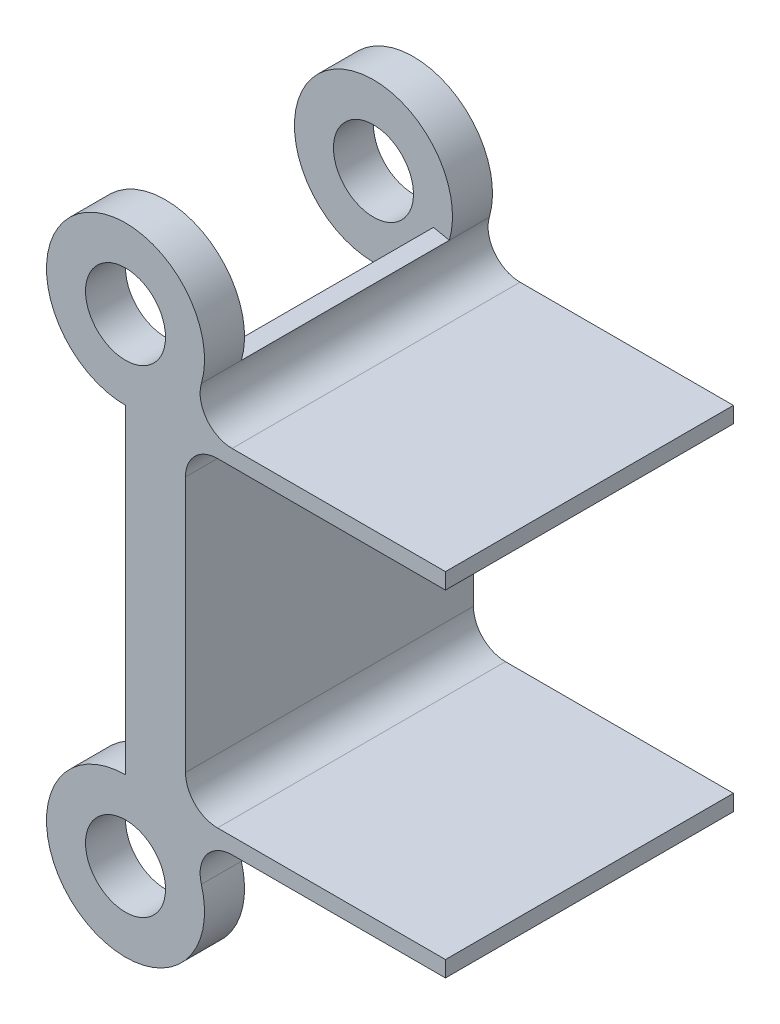
ISO-10303-21;
HEADER;
FILE_DESCRIPTION(('STEP AP214'),'2;1');
FILE_NAME('part.step','',(''),(''),'','','');
FILE_SCHEMA(('AUTOMOTIVE_DESIGN { 1 0 10303 214 1 1 1 1 }'));
ENDSEC;
DATA;
#1=APPLICATION_CONTEXT('core data for automotive mechanical design processes');
#2=APPLICATION_PROTOCOL_DEFINITION('international standard','automotive_design',2000,#1);
#3=PRODUCT_CONTEXT('',#1,'mechanical');
#4=PRODUCT('Part','Part','',(#3));
#5=PRODUCT_RELATED_PRODUCT_CATEGORY('part','',(#4));
#6=PRODUCT_DEFINITION_FORMATION('','',#4);
#7=PRODUCT_DEFINITION_CONTEXT('part definition',#1,'design');
#8=PRODUCT_DEFINITION('design','',#6,#7);
#9=PRODUCT_DEFINITION_SHAPE('','',#8);
#10=(LENGTH_UNIT() NAMED_UNIT(*) SI_UNIT(.MILLI.,.METRE.));
#11=(NAMED_UNIT(*) PLANE_ANGLE_UNIT() SI_UNIT($,.RADIAN.));
#12=(NAMED_UNIT(*) SI_UNIT($,.STERADIAN.) SOLID_ANGLE_UNIT());
#13=UNCERTAINTY_MEASURE_WITH_UNIT(LENGTH_MEASURE(1.E-05),#10,'distance_accuracy_value','');
#14=(GEOMETRIC_REPRESENTATION_CONTEXT(3) GLOBAL_UNCERTAINTY_ASSIGNED_CONTEXT((#13)) GLOBAL_UNIT_ASSIGNED_CONTEXT((#10,
#11,#12)) REPRESENTATION_CONTEXT('',''));
#15=CARTESIAN_POINT('',(0.,0.,0.));
#16=DIRECTION('',(0.,0.,1.));
#17=DIRECTION('',(1.,0.,0.));
#18=AXIS2_PLACEMENT_3D('',#15,#16,#17);
#19=CARTESIAN_POINT('',(0.,37.9476,22.86));
#20=DIRECTION('',(0.,0.,-1.));
#21=DIRECTION('',(-1.,0.,0.));
#22=AXIS2_PLACEMENT_3D('',#19,#20,#21);
#23=CYLINDRICAL_SURFACE('',#22,6.2738);
#24=DIRECTION('',(0.,0.,1.));
#25=VECTOR('',#24,1.);
#26=CARTESIAN_POINT('',(6.02369098499773,36.1938288184438,-5.09860980141071));
#27=LINE('',#26,#25);
#28=CARTESIAN_POINT('',(6.02369098499773,36.1938288184438,19.685));
#29=VERTEX_POINT('',#28);
#30=CARTESIAN_POINT('',(6.02369098499773,36.1938288184438,22.86));
#31=VERTEX_POINT('',#30);
#32=EDGE_CURVE('E206',#29,#31,#27,.T.);
#33=ORIENTED_EDGE('',*,*,#32,.F.);
#34=CARTESIAN_POINT('',(0.,37.9476,19.685));
#35=DIRECTION('',(0.,0.,1.));
#36=DIRECTION('',(-1.,0.,0.));
#37=AXIS2_PLACEMENT_3D('',#34,#35,#36);
#38=CIRCLE('',#37,6.2738);
#39=CARTESIAN_POINT('',(0.,31.6738,19.685));
#40=VERTEX_POINT('',#39);
#41=EDGE_CURVE('E669',#29,#40,#38,.T.);
#42=ORIENTED_EDGE('',*,*,#41,.T.);
#43=DIRECTION('',(0.,0.,-1.));
#44=VECTOR('',#43,1.);
#45=CARTESIAN_POINT('',(0.,31.6738,22.86));
#46=LINE('',#45,#44);
#47=CARTESIAN_POINT('',(0.,31.6738,22.86));
#48=VERTEX_POINT('',#47);
#49=EDGE_CURVE('E364',#48,#40,#46,.T.);
#50=ORIENTED_EDGE('',*,*,#49,.F.);
#51=CARTESIAN_POINT('',(0.,37.9476,22.86));
#52=DIRECTION('',(0.,0.,-1.));
#53=DIRECTION('',(1.,0.,0.));
#54=AXIS2_PLACEMENT_3D('',#51,#52,#53);
#55=CIRCLE('',#54,6.2738);
#56=EDGE_CURVE('E247',#48,#31,#55,.T.);
#57=ORIENTED_EDGE('',*,*,#56,.T.);
#58=EDGE_LOOP('',(#33,#42,#50,#57));
#59=FACE_BOUND('',#58,.T.);
#60=ADVANCED_FACE('F37',(#59),#23,.T.);
#61=CARTESIAN_POINT('',(0.,37.9476,22.86));
#62=DIRECTION('',(0.,0.,-1.));
#63=DIRECTION('',(-1.,0.,0.));
#64=AXIS2_PLACEMENT_3D('',#61,#62,#63);
#65=CYLINDRICAL_SURFACE('',#64,3.175);
#66=CARTESIAN_POINT('',(0.,37.9476,22.86));
#67=DIRECTION('',(0.,0.,-1.));
#68=DIRECTION('',(1.,0.,0.));
#69=AXIS2_PLACEMENT_3D('',#66,#67,#68);
#70=CIRCLE('',#69,3.175);
#71=CARTESIAN_POINT('',(3.175,37.9476,22.86));
#72=VERTEX_POINT('',#71);
#73=EDGE_CURVE('E241',#72,#72,#70,.T.);
#74=ORIENTED_EDGE('',*,*,#73,.F.);
#75=EDGE_LOOP('',(#74));
#76=FACE_BOUND('',#75,.T.);
#77=CARTESIAN_POINT('',(0.,37.9476,19.685));
#78=DIRECTION('',(0.,0.,-1.));
#79=DIRECTION('',(-1.,0.,0.));
#80=AXIS2_PLACEMENT_3D('',#77,#78,#79);
#81=CIRCLE('',#80,3.175);
#82=CARTESIAN_POINT('',(-3.175,37.9476,19.685));
#83=VERTEX_POINT('',#82);
#84=EDGE_CURVE('E235',#83,#83,#81,.F.);
#85=ORIENTED_EDGE('',*,*,#84,.F.);
#86=EDGE_LOOP('',(#85));
#87=FACE_BOUND('',#86,.T.);
#88=ADVANCED_FACE('F403',(#76,#87),#65,.F.);
#89=CARTESIAN_POINT('',(4.7625,4.08401275585667,-15.7054824963088));
#90=DIRECTION('',(1.,0.,0.));
#91=DIRECTION('',(0.,1.,0.));
#92=AXIS2_PLACEMENT_3D('',#89,#90,#91);
#93=PLANE('',#92);
#94=DIRECTION('',(0.,-1.,0.));
#95=VECTOR('',#94,1.);
#96=CARTESIAN_POINT('',(4.7625,4.08401275585667,0.));
#97=LINE('',#96,#95);
#98=CARTESIAN_POINT('',(4.7625,29.1338,0.));
#99=VERTEX_POINT('',#98);
#100=CARTESIAN_POINT('',(4.7625,8.8138,0.));
#101=VERTEX_POINT('',#100);
#102=EDGE_CURVE('E257',#99,#101,#97,.T.);
#103=ORIENTED_EDGE('',*,*,#102,.F.);
#104=DIRECTION('',(0.,0.,1.));
#105=VECTOR('',#104,1.);
#106=CARTESIAN_POINT('',(4.7625,29.1338,-15.7054824963088));
#107=LINE('',#106,#105);
#108=CARTESIAN_POINT('',(4.7625,29.1338,22.86));
#109=VERTEX_POINT('',#108);
#110=EDGE_CURVE('E367',#99,#109,#107,.T.);
#111=ORIENTED_EDGE('',*,*,#110,.T.);
#112=DIRECTION('',(0.,1.,0.));
#113=VECTOR('',#112,1.);
#114=CARTESIAN_POINT('',(4.7625,4.08401275585667,22.86));
#115=LINE('',#114,#113);
#116=CARTESIAN_POINT('',(4.7625,8.8138,22.86));
#117=VERTEX_POINT('',#116);
#118=EDGE_CURVE('E261',#117,#109,#115,.T.);
#119=ORIENTED_EDGE('',*,*,#118,.F.);
#120=DIRECTION('',(0.,0.,1.));
#121=VECTOR('',#120,1.);
#122=CARTESIAN_POINT('',(4.7625,8.8138,-15.7054824963088));
#123=LINE('',#122,#121);
#124=EDGE_CURVE('E356',#117,#101,#123,.F.);
#125=ORIENTED_EDGE('',*,*,#124,.T.);
#126=EDGE_LOOP('',(#103,#111,#119,#125));
#127=FACE_BOUND('',#126,.T.);
#128=ADVANCED_FACE('F386',(#127),#93,.T.);
#129=CARTESIAN_POINT('',(8.4624322744705,2.4638,22.86));
#130=DIRECTION('',(0.,0.,-1.));
#131=DIRECTION('',(-1.,0.,0.));
#132=AXIS2_PLACEMENT_3D('',#129,#130,#131);
#133=CYLINDRICAL_SURFACE('',#132,2.54);
#134=CARTESIAN_POINT('',(8.4624322744705,2.4638,16.51));
#135=DIRECTION('',(0.,0.,-1.));
#136=DIRECTION('',(-1.,0.,0.));
#137=AXIS2_PLACEMENT_3D('',#134,#135,#136);
#138=CIRCLE('',#137,2.54);
#139=CARTESIAN_POINT('',(8.46243227447051,5.0038,16.51));
#140=VERTEX_POINT('',#139);
#141=CARTESIAN_POINT('',(6.02369098499774,1.7537711815562,16.51));
#142=VERTEX_POINT('',#141);
#143=EDGE_CURVE('E274',#140,#142,#138,.F.);
#144=ORIENTED_EDGE('',*,*,#143,.F.);
#145=DIRECTION('',(0.,0.,-1.));
#146=VECTOR('',#145,1.);
#147=CARTESIAN_POINT('',(8.4624322744705,5.0038,0.));
#148=LINE('',#147,#146);
#149=CARTESIAN_POINT('',(8.4624322744705,5.0038,22.86));
#150=VERTEX_POINT('',#149);
#151=EDGE_CURVE('E338',#150,#140,#148,.T.);
#152=ORIENTED_EDGE('',*,*,#151,.F.);
#153=CARTESIAN_POINT('',(8.4624322744705,2.4638,22.86));
#154=DIRECTION('',(0.,0.,1.));
#155=DIRECTION('',(1.,0.,0.));
#156=AXIS2_PLACEMENT_3D('',#153,#154,#155);
#157=CIRCLE('',#156,2.54);
#158=CARTESIAN_POINT('',(6.02369098499774,1.7537711815562,22.86));
#159=VERTEX_POINT('',#158);
#160=EDGE_CURVE('E341',#159,#150,#157,.F.);
#161=ORIENTED_EDGE('',*,*,#160,.F.);
#162=DIRECTION('',(0.,0.,-1.));
#163=VECTOR('',#162,1.);
#164=CARTESIAN_POINT('',(6.02369098499774,1.7537711815562,22.86));
#165=LINE('',#164,#163);
#166=CARTESIAN_POINT('',(6.02369098499773,1.7537711815562,19.685));
#167=VERTEX_POINT('',#166);
#168=EDGE_CURVE('E329',#167,#159,#165,.F.);
#169=ORIENTED_EDGE('',*,*,#168,.F.);
#170=EDGE_CURVE('E337',#142,#167,#165,.F.);
#171=ORIENTED_EDGE('',*,*,#170,.F.);
#172=EDGE_LOOP('',(#144,#152,#161,#169,#171));
#173=FACE_BOUND('',#172,.T.);
#174=ADVANCED_FACE('F470',(#173),#133,.F.);
#175=CARTESIAN_POINT('',(0.,0.,22.86));
#176=DIRECTION('',(0.,0.,-1.));
#177=DIRECTION('',(-1.,0.,0.));
#178=AXIS2_PLACEMENT_3D('',#175,#176,#177);
#179=CYLINDRICAL_SURFACE('',#178,6.2738);
#180=CARTESIAN_POINT('',(0.,0.,19.685));
#181=DIRECTION('',(0.,0.,-1.));
#182=DIRECTION('',(-1.,0.,0.));
#183=AXIS2_PLACEMENT_3D('',#180,#181,#182);
#184=CIRCLE('',#183,6.2738);
#185=CARTESIAN_POINT('',(0.,6.2738,19.685));
#186=VERTEX_POINT('',#185);
#187=EDGE_CURVE('E284',#167,#186,#184,.T.);
#188=ORIENTED_EDGE('',*,*,#187,.F.);
#189=ORIENTED_EDGE('',*,*,#168,.T.);
#190=CARTESIAN_POINT('',(0.,0.,22.86));
#191=DIRECTION('',(0.,0.,1.));
#192=DIRECTION('',(1.,0.,0.));
#193=AXIS2_PLACEMENT_3D('',#190,#191,#192);
#194=CIRCLE('',#193,6.2738);
#195=CARTESIAN_POINT('',(0.,6.2738,22.86));
#196=VERTEX_POINT('',#195);
#197=EDGE_CURVE('E326',#196,#159,#194,.T.);
#198=ORIENTED_EDGE('',*,*,#197,.F.);
#199=DIRECTION('',(0.,0.,1.));
#200=VECTOR('',#199,1.);
#201=CARTESIAN_POINT('',(0.,6.2738,22.86));
#202=LINE('',#201,#200);
#203=EDGE_CURVE('E295',#186,#196,#202,.T.);
#204=ORIENTED_EDGE('',*,*,#203,.F.);
#205=EDGE_LOOP('',(#188,#189,#198,#204));
#206=FACE_BOUND('',#205,.T.);
#207=ADVANCED_FACE('F463',(#206),#179,.T.);
#208=CARTESIAN_POINT('',(0.,0.,22.86));
#209=DIRECTION('',(0.,0.,-1.));
#210=DIRECTION('',(-1.,0.,0.));
#211=AXIS2_PLACEMENT_3D('',#208,#209,#210);
#212=CYLINDRICAL_SURFACE('',#211,3.175);
#213=CARTESIAN_POINT('',(0.,0.,22.86));
#214=DIRECTION('',(0.,0.,1.));
#215=DIRECTION('',(1.,0.,0.));
#216=AXIS2_PLACEMENT_3D('',#213,#214,#215);
#217=CIRCLE('',#216,3.175);
#218=CARTESIAN_POINT('',(3.175,0.,22.86));
#219=VERTEX_POINT('',#218);
#220=EDGE_CURVE('E320',#219,#219,#217,.T.);
#221=ORIENTED_EDGE('',*,*,#220,.T.);
#222=EDGE_LOOP('',(#221));
#223=FACE_BOUND('',#222,.T.);
#224=CARTESIAN_POINT('',(0.,0.,19.685));
#225=DIRECTION('',(0.,0.,-1.));
#226=DIRECTION('',(-1.,0.,0.));
#227=AXIS2_PLACEMENT_3D('',#224,#225,#226);
#228=CIRCLE('',#227,3.175);
#229=CARTESIAN_POINT('',(-3.175,0.,19.685));
#230=VERTEX_POINT('',#229);
#231=EDGE_CURVE('E289',#230,#230,#228,.T.);
#232=ORIENTED_EDGE('',*,*,#231,.T.);
#233=EDGE_LOOP('',(#232));
#234=FACE_BOUND('',#233,.T.);
#235=ADVANCED_FACE('F528',(#223,#234),#212,.F.);
#236=CARTESIAN_POINT('',(0.,0.,22.86));
#237=DIRECTION('',(0.,0.,1.));
#238=DIRECTION('',(1.,0.,0.));
#239=AXIS2_PLACEMENT_3D('',#236,#237,#238);
#240=PLANE('',#239);
#241=CARTESIAN_POINT('',(8.4624322744705,35.4838,22.86));
#242=DIRECTION('',(0.,0.,-1.));
#243=DIRECTION('',(1.,0.,0.));
#244=AXIS2_PLACEMENT_3D('',#241,#242,#243);
#245=CIRCLE('',#244,2.54);
#246=CARTESIAN_POINT('',(8.4624322744705,32.9438,22.86));
#247=VERTEX_POINT('',#246);
#248=EDGE_CURVE('E199',#247,#31,#245,.T.);
#249=ORIENTED_EDGE('',*,*,#248,.T.);
#250=ORIENTED_EDGE('',*,*,#56,.F.);
#251=DIRECTION('',(0.,1.,0.));
#252=VECTOR('',#251,1.);
#253=CARTESIAN_POINT('',(0.,6.2738,22.86));
#254=LINE('',#253,#252);
#255=EDGE_CURVE('E254',#196,#48,#254,.T.);
#256=ORIENTED_EDGE('',*,*,#255,.F.);
#257=ORIENTED_EDGE('',*,*,#197,.T.);
#258=ORIENTED_EDGE('',*,*,#160,.T.);
#259=DIRECTION('',(1.,0.,0.));
#260=VECTOR('',#259,1.);
#261=CARTESIAN_POINT('',(0.,5.0038,22.86));
#262=LINE('',#261,#260);
#263=CARTESIAN_POINT('',(25.4,5.0038,22.86));
#264=VERTEX_POINT('',#263);
#265=EDGE_CURVE('E296',#150,#264,#262,.T.);
#266=ORIENTED_EDGE('',*,*,#265,.T.);
#267=DIRECTION('',(0.,1.,0.));
#268=VECTOR('',#267,1.);
#269=CARTESIAN_POINT('',(25.4,5.0038,22.86));
#270=LINE('',#269,#268);
#271=CARTESIAN_POINT('',(25.4,6.2738,22.86));
#272=VERTEX_POINT('',#271);
#273=EDGE_CURVE('E305',#264,#272,#270,.T.);
#274=ORIENTED_EDGE('',*,*,#273,.T.);
#275=DIRECTION('',(1.,0.,0.));
#276=VECTOR('',#275,1.);
#277=CARTESIAN_POINT('',(0.,6.2738,22.86));
#278=LINE('',#277,#276);
#279=CARTESIAN_POINT('',(7.3025,6.2738,22.86));
#280=VERTEX_POINT('',#279);
#281=EDGE_CURVE('E308',#280,#272,#278,.T.);
#282=ORIENTED_EDGE('',*,*,#281,.F.);
#283=CARTESIAN_POINT('',(7.3025,8.8138,22.86));
#284=DIRECTION('',(0.,0.,1.));
#285=DIRECTION('',(1.,0.,0.));
#286=AXIS2_PLACEMENT_3D('',#283,#284,#285);
#287=CIRCLE('',#286,2.54);
#288=EDGE_CURVE('E359',#280,#117,#287,.F.);
#289=ORIENTED_EDGE('',*,*,#288,.T.);
#290=ORIENTED_EDGE('',*,*,#118,.T.);
#291=CARTESIAN_POINT('',(7.3025,29.1338,22.86));
#292=DIRECTION('',(0.,0.,1.));
#293=DIRECTION('',(1.,0.,0.));
#294=AXIS2_PLACEMENT_3D('',#291,#292,#293);
#295=CIRCLE('',#294,2.54);
#296=CARTESIAN_POINT('',(7.3025,31.6738,22.86));
#297=VERTEX_POINT('',#296);
#298=EDGE_CURVE('E52',#109,#297,#295,.F.);
#299=ORIENTED_EDGE('',*,*,#298,.T.);
#300=DIRECTION('',(1.,0.,0.));
#301=VECTOR('',#300,1.);
#302=CARTESIAN_POINT('',(0.,31.6738,22.86));
#303=LINE('',#302,#301);
#304=CARTESIAN_POINT('',(25.4,31.6738,22.86));
#305=VERTEX_POINT('',#304);
#306=EDGE_CURVE('E237',#297,#305,#303,.T.);
#307=ORIENTED_EDGE('',*,*,#306,.T.);
#308=DIRECTION('',(0.,-1.,0.));
#309=VECTOR('',#308,1.);
#310=CARTESIAN_POINT('',(25.4,32.9438,22.86));
#311=LINE('',#310,#309);
#312=CARTESIAN_POINT('',(25.4,32.9438,22.86));
#313=VERTEX_POINT('',#312);
#314=EDGE_CURVE('E222',#313,#305,#311,.T.);
#315=ORIENTED_EDGE('',*,*,#314,.F.);
#316=DIRECTION('',(1.,0.,0.));
#317=VECTOR('',#316,1.);
#318=CARTESIAN_POINT('',(0.,32.9438,22.86));
#319=LINE('',#318,#317);
#320=EDGE_CURVE('E214',#247,#313,#319,.T.);
#321=ORIENTED_EDGE('',*,*,#320,.F.);
#322=EDGE_LOOP('',(#249,#250,#256,#257,#258,#266,#274,#282,#289,#290,#299,#307,#315,#321));
#323=FACE_BOUND('',#322,.T.);
#324=ORIENTED_EDGE('',*,*,#73,.T.);
#325=EDGE_LOOP('',(#324));
#326=FACE_BOUND('',#325,.T.);
#327=ORIENTED_EDGE('',*,*,#220,.F.);
#328=EDGE_LOOP('',(#327));
#329=FACE_BOUND('',#328,.T.);
#330=ADVANCED_FACE('F219',(#323,#326,#329),#240,.T.);
#331=CARTESIAN_POINT('',(0.,0.,0.));
#332=DIRECTION('',(0.,0.,1.));
#333=DIRECTION('',(1.,0.,0.));
#334=AXIS2_PLACEMENT_3D('',#331,#332,#333);
#335=PLANE('',#334);
#336=CARTESIAN_POINT('',(0.,37.9476,0.));
#337=DIRECTION('',(0.,0.,-1.));
#338=DIRECTION('',(1.,0.,0.));
#339=AXIS2_PLACEMENT_3D('',#336,#337,#338);
#340=CIRCLE('',#339,6.2738);
#341=CARTESIAN_POINT('',(0.,31.6738,0.));
#342=VERTEX_POINT('',#341);
#343=CARTESIAN_POINT('',(6.02369098499773,36.1938288184438,0.));
#344=VERTEX_POINT('',#343);
#345=EDGE_CURVE('E244',#342,#344,#340,.T.);
#346=ORIENTED_EDGE('',*,*,#345,.T.);
#347=CARTESIAN_POINT('',(8.4624322744705,35.4838,0.));
#348=DIRECTION('',(0.,0.,1.));
#349=DIRECTION('',(1.,0.,0.));
#350=AXIS2_PLACEMENT_3D('',#347,#348,#349);
#351=CIRCLE('',#350,2.54);
#352=CARTESIAN_POINT('',(8.4624322744705,32.9438,0.));
#353=VERTEX_POINT('',#352);
#354=EDGE_CURVE('E434',#344,#353,#351,.T.);
#355=ORIENTED_EDGE('',*,*,#354,.T.);
#356=DIRECTION('',(-1.,0.,0.));
#357=VECTOR('',#356,1.);
#358=CARTESIAN_POINT('',(0.,32.9438,0.));
#359=LINE('',#358,#357);
#360=CARTESIAN_POINT('',(25.4,32.9438,0.));
#361=VERTEX_POINT('',#360);
#362=EDGE_CURVE('E217',#361,#353,#359,.T.);
#363=ORIENTED_EDGE('',*,*,#362,.F.);
#364=DIRECTION('',(0.,-1.,0.));
#365=VECTOR('',#364,1.);
#366=CARTESIAN_POINT('',(25.4,32.9438,0.));
#367=LINE('',#366,#365);
#368=CARTESIAN_POINT('',(25.4,31.6738,0.));
#369=VERTEX_POINT('',#368);
#370=EDGE_CURVE('E224',#361,#369,#367,.T.);
#371=ORIENTED_EDGE('',*,*,#370,.T.);
#372=DIRECTION('',(-1.,0.,0.));
#373=VECTOR('',#372,1.);
#374=CARTESIAN_POINT('',(0.,31.6738,0.));
#375=LINE('',#374,#373);
#376=CARTESIAN_POINT('',(7.3025,31.6738,0.));
#377=VERTEX_POINT('',#376);
#378=EDGE_CURVE('E232',#369,#377,#375,.T.);
#379=ORIENTED_EDGE('',*,*,#378,.T.);
#380=CARTESIAN_POINT('',(7.3025,29.1338,0.));
#381=DIRECTION('',(0.,0.,1.));
#382=DIRECTION('',(1.,0.,0.));
#383=AXIS2_PLACEMENT_3D('',#380,#381,#382);
#384=CIRCLE('',#383,2.54);
#385=EDGE_CURVE('E45',#377,#99,#384,.T.);
#386=ORIENTED_EDGE('',*,*,#385,.T.);
#387=ORIENTED_EDGE('',*,*,#102,.T.);
#388=CARTESIAN_POINT('',(7.3025,8.8138,0.));
#389=DIRECTION('',(0.,0.,1.));
#390=DIRECTION('',(1.,0.,0.));
#391=AXIS2_PLACEMENT_3D('',#388,#389,#390);
#392=CIRCLE('',#391,2.54);
#393=CARTESIAN_POINT('',(7.3025,6.2738,0.));
#394=VERTEX_POINT('',#393);
#395=EDGE_CURVE('E361',#101,#394,#392,.T.);
#396=ORIENTED_EDGE('',*,*,#395,.T.);
#397=DIRECTION('',(-1.,0.,0.));
#398=VECTOR('',#397,1.);
#399=CARTESIAN_POINT('',(0.,6.2738,0.));
#400=LINE('',#399,#398);
#401=CARTESIAN_POINT('',(25.4,6.2738,0.));
#402=VERTEX_POINT('',#401);
#403=EDGE_CURVE('E299',#402,#394,#400,.T.);
#404=ORIENTED_EDGE('',*,*,#403,.F.);
#405=DIRECTION('',(0.,1.,0.));
#406=VECTOR('',#405,1.);
#407=CARTESIAN_POINT('',(25.4,5.0038,0.));
#408=LINE('',#407,#406);
#409=CARTESIAN_POINT('',(25.4,5.0038,0.));
#410=VERTEX_POINT('',#409);
#411=EDGE_CURVE('E315',#410,#402,#408,.T.);
#412=ORIENTED_EDGE('',*,*,#411,.F.);
#413=DIRECTION('',(-1.,0.,0.));
#414=VECTOR('',#413,1.);
#415=CARTESIAN_POINT('',(0.,5.0038,0.));
#416=LINE('',#415,#414);
#417=CARTESIAN_POINT('',(8.4624322744705,5.0038,0.));
#418=VERTEX_POINT('',#417);
#419=EDGE_CURVE('E302',#410,#418,#416,.T.);
#420=ORIENTED_EDGE('',*,*,#419,.T.);
#421=CARTESIAN_POINT('',(8.4624322744705,2.4638,0.));
#422=DIRECTION('',(0.,0.,1.));
#423=DIRECTION('',(1.,0.,0.));
#424=AXIS2_PLACEMENT_3D('',#421,#422,#423);
#425=CIRCLE('',#424,2.54);
#426=CARTESIAN_POINT('',(6.02369098499774,1.7537711815562,0.));
#427=VERTEX_POINT('',#426);
#428=EDGE_CURVE('E343',#418,#427,#425,.T.);
#429=ORIENTED_EDGE('',*,*,#428,.T.);
#430=CARTESIAN_POINT('',(0.,0.,0.));
#431=DIRECTION('',(0.,0.,1.));
#432=DIRECTION('',(1.,0.,0.));
#433=AXIS2_PLACEMENT_3D('',#430,#431,#432);
#434=CIRCLE('',#433,6.2738);
#435=CARTESIAN_POINT('',(0.,6.2738,0.));
#436=VERTEX_POINT('',#435);
#437=EDGE_CURVE('E323',#436,#427,#434,.T.);
#438=ORIENTED_EDGE('',*,*,#437,.F.);
#439=DIRECTION('',(0.,-1.,0.));
#440=VECTOR('',#439,1.);
#441=CARTESIAN_POINT('',(0.,6.2738,0.));
#442=LINE('',#441,#440);
#443=EDGE_CURVE('E255',#342,#436,#442,.T.);
#444=ORIENTED_EDGE('',*,*,#443,.F.);
#445=EDGE_LOOP('',(#346,#355,#363,#371,#379,#386,#387,#396,#404,#412,#420,#429,#438,#444));
#446=FACE_BOUND('',#445,.T.);
#447=CARTESIAN_POINT('',(0.,37.9476,0.));
#448=DIRECTION('',(0.,0.,-1.));
#449=DIRECTION('',(1.,0.,0.));
#450=AXIS2_PLACEMENT_3D('',#447,#448,#449);
#451=CIRCLE('',#450,3.175);
#452=CARTESIAN_POINT('',(3.175,37.9476,0.));
#453=VERTEX_POINT('',#452);
#454=EDGE_CURVE('E239',#453,#453,#451,.T.);
#455=ORIENTED_EDGE('',*,*,#454,.F.);
#456=EDGE_LOOP('',(#455));
#457=FACE_BOUND('',#456,.T.);
#458=CARTESIAN_POINT('',(0.,0.,0.));
#459=DIRECTION('',(0.,0.,1.));
#460=DIRECTION('',(1.,0.,0.));
#461=AXIS2_PLACEMENT_3D('',#458,#459,#460);
#462=CIRCLE('',#461,3.175);
#463=CARTESIAN_POINT('',(3.175,0.,0.));
#464=VERTEX_POINT('',#463);
#465=EDGE_CURVE('E317',#464,#464,#462,.T.);
#466=ORIENTED_EDGE('',*,*,#465,.T.);
#467=EDGE_LOOP('',(#466));
#468=FACE_BOUND('',#467,.T.);
#469=ADVANCED_FACE('F381',(#446,#457,#468),#335,.F.);
#470=CARTESIAN_POINT('',(6.02369098499774,1.7537711815562,3.175));
#471=VERTEX_POINT('',#470);
#472=EDGE_CURVE('E332',#427,#471,#165,.F.);
#473=ORIENTED_EDGE('',*,*,#472,.T.);
#474=CARTESIAN_POINT('',(0.,0.,3.175));
#475=DIRECTION('',(0.,0.,-1.));
#476=DIRECTION('',(-1.,0.,0.));
#477=AXIS2_PLACEMENT_3D('',#474,#475,#476);
#478=CIRCLE('',#477,6.2738);
#479=CARTESIAN_POINT('',(0.,6.2738,3.175));
#480=VERTEX_POINT('',#479);
#481=EDGE_CURVE('E280',#471,#480,#478,.T.);
#482=ORIENTED_EDGE('',*,*,#481,.T.);
#483=EDGE_CURVE('E306',#436,#480,#202,.T.);
#484=ORIENTED_EDGE('',*,*,#483,.F.);
#485=ORIENTED_EDGE('',*,*,#437,.T.);
#486=EDGE_LOOP('',(#473,#482,#484,#485));
#487=FACE_BOUND('',#486,.T.);
#488=ADVANCED_FACE('F443',(#487),#179,.T.);
#489=CARTESIAN_POINT('',(0.,0.,3.175));
#490=DIRECTION('',(0.,0.,-1.));
#491=DIRECTION('',(-1.,0.,0.));
#492=AXIS2_PLACEMENT_3D('',#489,#490,#491);
#493=CIRCLE('',#492,3.175);
#494=CARTESIAN_POINT('',(-3.175,0.,3.175));
#495=VERTEX_POINT('',#494);
#496=EDGE_CURVE('E283',#495,#495,#493,.T.);
#497=ORIENTED_EDGE('',*,*,#496,.F.);
#498=EDGE_LOOP('',(#497));
#499=FACE_BOUND('',#498,.T.);
#500=ORIENTED_EDGE('',*,*,#465,.F.);
#501=EDGE_LOOP('',(#500));
#502=FACE_BOUND('',#501,.T.);
#503=ADVANCED_FACE('F520',(#499,#502),#212,.F.);
#504=CARTESIAN_POINT('',(0.,5.0038,0.));
#505=DIRECTION('',(0.,-1.,0.));
#506=DIRECTION('',(0.,0.,-1.));
#507=AXIS2_PLACEMENT_3D('',#504,#505,#506);
#508=PLANE('',#507);
#509=DIRECTION('',(0.,0.,1.));
#510=VECTOR('',#509,1.);
#511=CARTESIAN_POINT('',(4.7625,5.0038,0.));
#512=LINE('',#511,#510);
#513=CARTESIAN_POINT('',(4.7625,5.0038,6.35));
#514=VERTEX_POINT('',#513);
#515=CARTESIAN_POINT('',(4.7625,5.0038,16.51));
#516=VERTEX_POINT('',#515);
#517=EDGE_CURVE('E266',#514,#516,#512,.T.);
#518=ORIENTED_EDGE('',*,*,#517,.F.);
#519=DIRECTION('',(1.,0.,0.));
#520=VECTOR('',#519,1.);
#521=CARTESIAN_POINT('',(8.46243227447051,5.0038,6.35));
#522=LINE('',#521,#520);
#523=CARTESIAN_POINT('',(8.46243227447051,5.0038,6.35));
#524=VERTEX_POINT('',#523);
#525=EDGE_CURVE('E272',#514,#524,#522,.T.);
#526=ORIENTED_EDGE('',*,*,#525,.T.);
#527=EDGE_CURVE('E335',#524,#418,#148,.T.);
#528=ORIENTED_EDGE('',*,*,#527,.T.);
#529=ORIENTED_EDGE('',*,*,#419,.F.);
#530=DIRECTION('',(0.,0.,-1.));
#531=VECTOR('',#530,1.);
#532=CARTESIAN_POINT('',(25.4,5.0038,22.86));
#533=LINE('',#532,#531);
#534=EDGE_CURVE('E298',#264,#410,#533,.T.);
#535=ORIENTED_EDGE('',*,*,#534,.F.);
#536=ORIENTED_EDGE('',*,*,#265,.F.);
#537=ORIENTED_EDGE('',*,*,#151,.T.);
#538=DIRECTION('',(1.,0.,0.));
#539=VECTOR('',#538,1.);
#540=CARTESIAN_POINT('',(8.46243227447051,5.0038,16.51));
#541=LINE('',#540,#539);
#542=EDGE_CURVE('E271',#516,#140,#541,.T.);
#543=ORIENTED_EDGE('',*,*,#542,.F.);
#544=EDGE_LOOP('',(#518,#526,#528,#529,#535,#536,#537,#543));
#545=FACE_BOUND('',#544,.T.);
#546=ADVANCED_FACE('F481',(#545),#508,.T.);
#547=CARTESIAN_POINT('',(25.4,5.0038,22.86));
#548=DIRECTION('',(1.,0.,0.));
#549=DIRECTION('',(0.,0.,-1.));
#550=AXIS2_PLACEMENT_3D('',#547,#548,#549);
#551=PLANE('',#550);
#552=DIRECTION('',(0.,0.,-1.));
#553=VECTOR('',#552,1.);
#554=CARTESIAN_POINT('',(25.4,6.2738,22.86));
#555=LINE('',#554,#553);
#556=EDGE_CURVE('E310',#272,#402,#555,.T.);
#557=ORIENTED_EDGE('',*,*,#556,.F.);
#558=ORIENTED_EDGE('',*,*,#273,.F.);
#559=ORIENTED_EDGE('',*,*,#534,.T.);
#560=ORIENTED_EDGE('',*,*,#411,.T.);
#561=EDGE_LOOP('',(#557,#558,#559,#560));
#562=FACE_BOUND('',#561,.T.);
#563=ADVANCED_FACE('F488',(#562),#551,.T.);
#564=CARTESIAN_POINT('',(0.,6.2738,0.));
#565=DIRECTION('',(0.,-1.,0.));
#566=DIRECTION('',(0.,0.,-1.));
#567=AXIS2_PLACEMENT_3D('',#564,#565,#566);
#568=PLANE('',#567);
#569=ORIENTED_EDGE('',*,*,#403,.T.);
#570=DIRECTION('',(0.,0.,1.));
#571=VECTOR('',#570,1.);
#572=CARTESIAN_POINT('',(7.3025,6.2738,0.));
#573=LINE('',#572,#571);
#574=EDGE_CURVE('E353',#394,#280,#573,.T.);
#575=ORIENTED_EDGE('',*,*,#574,.T.);
#576=ORIENTED_EDGE('',*,*,#281,.T.);
#577=ORIENTED_EDGE('',*,*,#556,.T.);
#578=EDGE_LOOP('',(#569,#575,#576,#577));
#579=FACE_BOUND('',#578,.T.);
#580=ADVANCED_FACE('F491',(#579),#568,.F.);
#581=ORIENTED_EDGE('',*,*,#527,.F.);
#582=CARTESIAN_POINT('',(8.4624322744705,2.4638,6.35));
#583=DIRECTION('',(0.,0.,-1.));
#584=DIRECTION('',(-1.,0.,0.));
#585=AXIS2_PLACEMENT_3D('',#582,#583,#584);
#586=CIRCLE('',#585,2.54);
#587=CARTESIAN_POINT('',(6.02369098499773,1.7537711815562,6.35));
#588=VERTEX_POINT('',#587);
#589=EDGE_CURVE('E277',#524,#588,#586,.F.);
#590=ORIENTED_EDGE('',*,*,#589,.T.);
#591=EDGE_CURVE('E336',#471,#588,#165,.F.);
#592=ORIENTED_EDGE('',*,*,#591,.F.);
#593=ORIENTED_EDGE('',*,*,#472,.F.);
#594=ORIENTED_EDGE('',*,*,#428,.F.);
#595=EDGE_LOOP('',(#581,#590,#592,#593,#594));
#596=FACE_BOUND('',#595,.T.);
#597=ADVANCED_FACE('F453',(#596),#133,.F.);
#598=CARTESIAN_POINT('',(0.,0.,19.685));
#599=DIRECTION('',(0.,0.,-1.));
#600=DIRECTION('',(-1.,0.,0.));
#601=AXIS2_PLACEMENT_3D('',#598,#599,#600);
#602=CYLINDRICAL_SURFACE('',#601,6.2738);
#603=CARTESIAN_POINT('',(0.,0.,6.35));
#604=DIRECTION('',(0.,0.,-1.));
#605=DIRECTION('',(-1.,0.,0.));
#606=AXIS2_PLACEMENT_3D('',#603,#604,#605);
#607=CIRCLE('',#606,6.2738);
#608=CARTESIAN_POINT('',(4.7625,4.08401275585667,6.35));
#609=VERTEX_POINT('',#608);
#610=EDGE_CURVE('E347',#588,#609,#607,.F.);
#611=ORIENTED_EDGE('',*,*,#610,.T.);
#612=DIRECTION('',(0.,0.,1.));
#613=VECTOR('',#612,1.);
#614=CARTESIAN_POINT('',(4.7625,4.08401275585667,-15.7054824963088));
#615=LINE('',#614,#613);
#616=CARTESIAN_POINT('',(4.7625,4.08401275585667,16.51));
#617=VERTEX_POINT('',#616);
#618=EDGE_CURVE('E258',#609,#617,#615,.T.);
#619=ORIENTED_EDGE('',*,*,#618,.T.);
#620=CARTESIAN_POINT('',(0.,0.,16.51));
#621=DIRECTION('',(0.,0.,-1.));
#622=DIRECTION('',(-1.,0.,0.));
#623=AXIS2_PLACEMENT_3D('',#620,#621,#622);
#624=CIRCLE('',#623,6.2738);
#625=EDGE_CURVE('E345',#142,#617,#624,.F.);
#626=ORIENTED_EDGE('',*,*,#625,.F.);
#627=ORIENTED_EDGE('',*,*,#170,.T.);
#628=EDGE_CURVE('E281',#186,#167,#184,.T.);
#629=ORIENTED_EDGE('',*,*,#628,.F.);
#630=DIRECTION('',(0.,0.,-1.));
#631=VECTOR('',#630,1.);
#632=CARTESIAN_POINT('',(0.,6.2738,19.685));
#633=LINE('',#632,#631);
#634=EDGE_CURVE('E292',#186,#480,#633,.T.);
#635=ORIENTED_EDGE('',*,*,#634,.T.);
#636=EDGE_CURVE('E285',#480,#471,#478,.T.);
#637=ORIENTED_EDGE('',*,*,#636,.T.);
#638=ORIENTED_EDGE('',*,*,#591,.T.);
#639=EDGE_LOOP('',(#611,#619,#626,#627,#629,#635,#637,#638));
#640=FACE_BOUND('',#639,.T.);
#641=ADVANCED_FACE('F476',(#640),#602,.F.);
#642=CARTESIAN_POINT('',(0.,0.,19.685));
#643=DIRECTION('',(0.,0.,-1.));
#644=DIRECTION('',(-1.,0.,0.));
#645=AXIS2_PLACEMENT_3D('',#642,#643,#644);
#646=PLANE('',#645);
#647=ORIENTED_EDGE('',*,*,#231,.F.);
#648=EDGE_LOOP('',(#647));
#649=FACE_BOUND('',#648,.T.);
#650=ORIENTED_EDGE('',*,*,#628,.T.);
#651=ORIENTED_EDGE('',*,*,#187,.T.);
#652=EDGE_LOOP('',(#650,#651));
#653=FACE_BOUND('',#652,.T.);
#654=ADVANCED_FACE('F475',(#649,#653),#646,.T.);
#655=CARTESIAN_POINT('',(0.,0.,3.175));
#656=DIRECTION('',(0.,0.,-1.));
#657=DIRECTION('',(-1.,0.,0.));
#658=AXIS2_PLACEMENT_3D('',#655,#656,#657);
#659=PLANE('',#658);
#660=ORIENTED_EDGE('',*,*,#496,.T.);
#661=EDGE_LOOP('',(#660));
#662=FACE_BOUND('',#661,.T.);
#663=ORIENTED_EDGE('',*,*,#636,.F.);
#664=ORIENTED_EDGE('',*,*,#481,.F.);
#665=EDGE_LOOP('',(#663,#664));
#666=FACE_BOUND('',#665,.T.);
#667=ADVANCED_FACE('F449',(#662,#666),#659,.F.);
#668=CARTESIAN_POINT('',(0.,0.,6.35));
#669=DIRECTION('',(0.,0.,-1.));
#670=DIRECTION('',(-1.,0.,0.));
#671=AXIS2_PLACEMENT_3D('',#668,#669,#670);
#672=PLANE('',#671);
#673=ORIENTED_EDGE('',*,*,#525,.F.);
#674=DIRECTION('',(0.,-1.,0.));
#675=VECTOR('',#674,1.);
#676=CARTESIAN_POINT('',(4.7625,0.,6.35));
#677=LINE('',#676,#675);
#678=EDGE_CURVE('E269',#514,#609,#677,.T.);
#679=ORIENTED_EDGE('',*,*,#678,.T.);
#680=ORIENTED_EDGE('',*,*,#610,.F.);
#681=ORIENTED_EDGE('',*,*,#589,.F.);
#682=EDGE_LOOP('',(#673,#679,#680,#681));
#683=FACE_BOUND('',#682,.T.);
#684=ADVANCED_FACE('F496',(#683),#672,.F.);
#685=CARTESIAN_POINT('',(0.,0.,16.51));
#686=DIRECTION('',(0.,0.,-1.));
#687=DIRECTION('',(-1.,0.,0.));
#688=AXIS2_PLACEMENT_3D('',#685,#686,#687);
#689=PLANE('',#688);
#690=DIRECTION('',(0.,-1.,0.));
#691=VECTOR('',#690,1.);
#692=CARTESIAN_POINT('',(4.7625,0.,16.51));
#693=LINE('',#692,#691);
#694=EDGE_CURVE('E350',#516,#617,#693,.T.);
#695=ORIENTED_EDGE('',*,*,#694,.F.);
#696=ORIENTED_EDGE('',*,*,#542,.T.);
#697=ORIENTED_EDGE('',*,*,#143,.T.);
#698=ORIENTED_EDGE('',*,*,#625,.T.);
#699=EDGE_LOOP('',(#695,#696,#697,#698));
#700=FACE_BOUND('',#699,.T.);
#701=ADVANCED_FACE('F500',(#700),#689,.T.);
#702=ORIENTED_EDGE('',*,*,#678,.F.);
#703=ORIENTED_EDGE('',*,*,#517,.T.);
#704=ORIENTED_EDGE('',*,*,#694,.T.);
#705=ORIENTED_EDGE('',*,*,#618,.F.);
#706=EDGE_LOOP('',(#702,#703,#704,#705));
#707=FACE_BOUND('',#706,.T.);
#708=ADVANCED_FACE('F499',(#707),#93,.T.);
#709=CARTESIAN_POINT('',(0.,6.2738,-15.7054824963088));
#710=DIRECTION('',(1.,0.,0.));
#711=DIRECTION('',(0.,0.,-1.));
#712=AXIS2_PLACEMENT_3D('',#709,#710,#711);
#713=PLANE('',#712);
#714=ORIENTED_EDGE('',*,*,#255,.T.);
#715=ORIENTED_EDGE('',*,*,#49,.T.);
#716=CARTESIAN_POINT('',(0.,31.6738,3.175));
#717=VERTEX_POINT('',#716);
#718=EDGE_CURVE('E368',#40,#717,#46,.T.);
#719=ORIENTED_EDGE('',*,*,#718,.T.);
#720=EDGE_CURVE('E363',#717,#342,#46,.T.);
#721=ORIENTED_EDGE('',*,*,#720,.T.);
#722=ORIENTED_EDGE('',*,*,#443,.T.);
#723=ORIENTED_EDGE('',*,*,#483,.T.);
#724=ORIENTED_EDGE('',*,*,#634,.F.);
#725=ORIENTED_EDGE('',*,*,#203,.T.);
#726=EDGE_LOOP('',(#714,#715,#719,#721,#722,#723,#724,#725));
#727=FACE_BOUND('',#726,.T.);
#728=ADVANCED_FACE('F424',(#727),#713,.F.);
#729=CARTESIAN_POINT('',(7.3025,8.8138,0.));
#730=DIRECTION('',(0.,0.,1.));
#731=DIRECTION('',(1.,0.,0.));
#732=AXIS2_PLACEMENT_3D('',#729,#730,#731);
#733=CYLINDRICAL_SURFACE('',#732,2.54);
#734=ORIENTED_EDGE('',*,*,#395,.F.);
#735=ORIENTED_EDGE('',*,*,#124,.F.);
#736=ORIENTED_EDGE('',*,*,#288,.F.);
#737=ORIENTED_EDGE('',*,*,#574,.F.);
#738=EDGE_LOOP('',(#734,#735,#736,#737));
#739=FACE_BOUND('',#738,.T.);
#740=ADVANCED_FACE('F416',(#739),#733,.F.);
#741=CARTESIAN_POINT('',(6.02369098499773,36.1938288184438,3.175));
#742=VERTEX_POINT('',#741);
#743=EDGE_CURVE('E430',#344,#742,#27,.T.);
#744=ORIENTED_EDGE('',*,*,#743,.F.);
#745=ORIENTED_EDGE('',*,*,#345,.F.);
#746=ORIENTED_EDGE('',*,*,#720,.F.);
#747=CARTESIAN_POINT('',(0.,37.9476,3.175));
#748=DIRECTION('',(0.,0.,1.));
#749=DIRECTION('',(-1.,0.,0.));
#750=AXIS2_PLACEMENT_3D('',#747,#748,#749);
#751=CIRCLE('',#750,6.2738);
#752=EDGE_CURVE('E433',#742,#717,#751,.T.);
#753=ORIENTED_EDGE('',*,*,#752,.F.);
#754=EDGE_LOOP('',(#744,#745,#746,#753));
#755=FACE_BOUND('',#754,.T.);
#756=ADVANCED_FACE('F406',(#755),#23,.T.);
#757=CARTESIAN_POINT('',(0.,37.9476,3.175));
#758=DIRECTION('',(0.,0.,-1.));
#759=DIRECTION('',(-1.,0.,0.));
#760=AXIS2_PLACEMENT_3D('',#757,#758,#759);
#761=CIRCLE('',#760,3.175);
#762=CARTESIAN_POINT('',(-3.175,37.9476,3.175));
#763=VERTEX_POINT('',#762);
#764=EDGE_CURVE('E369',#763,#763,#761,.F.);
#765=ORIENTED_EDGE('',*,*,#764,.T.);
#766=EDGE_LOOP('',(#765));
#767=FACE_BOUND('',#766,.T.);
#768=ORIENTED_EDGE('',*,*,#454,.T.);
#769=EDGE_LOOP('',(#768));
#770=FACE_BOUND('',#769,.T.);
#771=ADVANCED_FACE('F413',(#767,#770),#65,.F.);
#772=CARTESIAN_POINT('',(25.4,32.9438,22.86));
#773=DIRECTION('',(-1.,0.,0.));
#774=DIRECTION('',(0.,0.,1.));
#775=AXIS2_PLACEMENT_3D('',#772,#773,#774);
#776=PLANE('',#775);
#777=DIRECTION('',(0.,0.,-1.));
#778=VECTOR('',#777,1.);
#779=CARTESIAN_POINT('',(25.4,31.6738,22.86));
#780=LINE('',#779,#778);
#781=EDGE_CURVE('E234',#305,#369,#780,.T.);
#782=ORIENTED_EDGE('',*,*,#781,.T.);
#783=ORIENTED_EDGE('',*,*,#370,.F.);
#784=DIRECTION('',(0.,0.,-1.));
#785=VECTOR('',#784,1.);
#786=CARTESIAN_POINT('',(25.4,32.9438,22.86));
#787=LINE('',#786,#785);
#788=EDGE_CURVE('E225',#313,#361,#787,.T.);
#789=ORIENTED_EDGE('',*,*,#788,.F.);
#790=ORIENTED_EDGE('',*,*,#314,.T.);
#791=EDGE_LOOP('',(#782,#783,#789,#790));
#792=FACE_BOUND('',#791,.T.);
#793=ADVANCED_FACE('F422',(#792),#776,.F.);
#794=CARTESIAN_POINT('',(0.,32.9438,0.));
#795=DIRECTION('',(0.,1.,0.));
#796=DIRECTION('',(0.,0.,-1.));
#797=AXIS2_PLACEMENT_3D('',#794,#795,#796);
#798=PLANE('',#797);
#799=DIRECTION('',(0.,0.,1.));
#800=VECTOR('',#799,1.);
#801=CARTESIAN_POINT('',(8.4624322744705,32.9438,-5.09860980141071));
#802=LINE('',#801,#800);
#803=EDGE_CURVE('E202',#353,#247,#802,.T.);
#804=ORIENTED_EDGE('',*,*,#803,.T.);
#805=ORIENTED_EDGE('',*,*,#320,.T.);
#806=ORIENTED_EDGE('',*,*,#788,.T.);
#807=ORIENTED_EDGE('',*,*,#362,.T.);
#808=EDGE_LOOP('',(#804,#805,#806,#807));
#809=FACE_BOUND('',#808,.T.);
#810=ADVANCED_FACE('F213',(#809),#798,.T.);
#811=CARTESIAN_POINT('',(0.,31.6738,0.));
#812=DIRECTION('',(0.,1.,0.));
#813=DIRECTION('',(0.,0.,-1.));
#814=AXIS2_PLACEMENT_3D('',#811,#812,#813);
#815=PLANE('',#814);
#816=ORIENTED_EDGE('',*,*,#306,.F.);
#817=DIRECTION('',(0.,0.,1.));
#818=VECTOR('',#817,1.);
#819=CARTESIAN_POINT('',(7.3025,31.6738,0.));
#820=LINE('',#819,#818);
#821=EDGE_CURVE('E59',#297,#377,#820,.F.);
#822=ORIENTED_EDGE('',*,*,#821,.T.);
#823=ORIENTED_EDGE('',*,*,#378,.F.);
#824=ORIENTED_EDGE('',*,*,#781,.F.);
#825=EDGE_LOOP('',(#816,#822,#823,#824));
#826=FACE_BOUND('',#825,.T.);
#827=ADVANCED_FACE('F583',(#826),#815,.F.);
#828=CARTESIAN_POINT('',(0.,37.9476,19.685));
#829=DIRECTION('',(0.,0.,-1.));
#830=DIRECTION('',(-1.,0.,0.));
#831=AXIS2_PLACEMENT_3D('',#828,#829,#830);
#832=PLANE('',#831);
#833=DIRECTION('',(0.979709254782678,-0.2004239908124,0.));
#834=VECTOR('',#833,1.);
#835=CARTESIAN_POINT('',(-0.10239534836406,37.4470727425976,19.685));
#836=LINE('',#835,#834);
#837=CARTESIAN_POINT('',(4.7625,36.4518369256,19.685));
#838=VERTEX_POINT('',#837);
#839=EDGE_CURVE('E672',#838,#29,#836,.T.);
#840=ORIENTED_EDGE('',*,*,#839,.F.);
#841=DIRECTION('',(0.,1.,0.));
#842=VECTOR('',#841,1.);
#843=CARTESIAN_POINT('',(4.7625,37.9476,19.685));
#844=LINE('',#843,#842);
#845=CARTESIAN_POINT('',(4.7625,33.8635872441433,19.685));
#846=VERTEX_POINT('',#845);
#847=EDGE_CURVE('E674',#846,#838,#844,.T.);
#848=ORIENTED_EDGE('',*,*,#847,.F.);
#849=EDGE_CURVE('E372',#40,#846,#38,.T.);
#850=ORIENTED_EDGE('',*,*,#849,.F.);
#851=ORIENTED_EDGE('',*,*,#41,.F.);
#852=EDGE_LOOP('',(#840,#848,#850,#851));
#853=FACE_BOUND('',#852,.T.);
#854=ORIENTED_EDGE('',*,*,#84,.T.);
#855=EDGE_LOOP('',(#854));
#856=FACE_BOUND('',#855,.T.);
#857=ADVANCED_FACE('F592',(#853,#856),#832,.T.);
#858=CARTESIAN_POINT('',(0.,37.9476,3.175));
#859=DIRECTION('',(0.,0.,-1.));
#860=DIRECTION('',(-1.,0.,0.));
#861=AXIS2_PLACEMENT_3D('',#858,#859,#860);
#862=PLANE('',#861);
#863=DIRECTION('',(0.,1.,0.));
#864=VECTOR('',#863,1.);
#865=CARTESIAN_POINT('',(4.7625,37.9476,3.175));
#866=LINE('',#865,#864);
#867=CARTESIAN_POINT('',(4.7625,33.8635872441433,3.175));
#868=VERTEX_POINT('',#867);
#869=CARTESIAN_POINT('',(4.7625,36.4518369256,3.175));
#870=VERTEX_POINT('',#869);
#871=EDGE_CURVE('E676',#868,#870,#866,.T.);
#872=ORIENTED_EDGE('',*,*,#871,.T.);
#873=DIRECTION('',(0.979709254782678,-0.2004239908124,0.));
#874=VECTOR('',#873,1.);
#875=CARTESIAN_POINT('',(-0.10239534836406,37.4470727425976,3.175));
#876=LINE('',#875,#874);
#877=EDGE_CURVE('E11',#870,#742,#876,.T.);
#878=ORIENTED_EDGE('',*,*,#877,.T.);
#879=ORIENTED_EDGE('',*,*,#752,.T.);
#880=EDGE_CURVE('E666',#717,#868,#751,.T.);
#881=ORIENTED_EDGE('',*,*,#880,.T.);
#882=EDGE_LOOP('',(#872,#878,#879,#881));
#883=FACE_BOUND('',#882,.T.);
#884=ORIENTED_EDGE('',*,*,#764,.F.);
#885=EDGE_LOOP('',(#884));
#886=FACE_BOUND('',#885,.T.);
#887=ADVANCED_FACE('F399',(#883,#886),#862,.F.);
#888=CARTESIAN_POINT('',(0.,37.9476,19.685));
#889=DIRECTION('',(0.,0.,-1.));
#890=DIRECTION('',(-1.,0.,0.));
#891=AXIS2_PLACEMENT_3D('',#888,#889,#890);
#892=CYLINDRICAL_SURFACE('',#891,6.2738);
#893=ORIENTED_EDGE('',*,*,#880,.F.);
#894=ORIENTED_EDGE('',*,*,#718,.F.);
#895=ORIENTED_EDGE('',*,*,#849,.T.);
#896=DIRECTION('',(0.,0.,-1.));
#897=VECTOR('',#896,1.);
#898=CARTESIAN_POINT('',(4.7625,33.8635872441433,22.86));
#899=LINE('',#898,#897);
#900=EDGE_CURVE('E249',#846,#868,#899,.T.);
#901=ORIENTED_EDGE('',*,*,#900,.T.);
#902=EDGE_LOOP('',(#893,#894,#895,#901));
#903=FACE_BOUND('',#902,.T.);
#904=ADVANCED_FACE('F392',(#903),#892,.F.);
#905=CARTESIAN_POINT('',(7.3025,29.1338,-15.7054824963088));
#906=DIRECTION('',(0.,0.,1.));
#907=DIRECTION('',(1.,0.,0.));
#908=AXIS2_PLACEMENT_3D('',#905,#906,#907);
#909=CYLINDRICAL_SURFACE('',#908,2.54);
#910=ORIENTED_EDGE('',*,*,#385,.F.);
#911=ORIENTED_EDGE('',*,*,#821,.F.);
#912=ORIENTED_EDGE('',*,*,#298,.F.);
#913=ORIENTED_EDGE('',*,*,#110,.F.);
#914=EDGE_LOOP('',(#910,#911,#912,#913));
#915=FACE_BOUND('',#914,.T.);
#916=ADVANCED_FACE('F39',(#915),#909,.F.);
#917=CARTESIAN_POINT('',(4.7625,36.4518369256,-5.09860980141071));
#918=DIRECTION('',(0.2004239908124,0.979709254782678,0.));
#919=DIRECTION('',(-0.979709254782678,0.2004239908124,0.));
#920=AXIS2_PLACEMENT_3D('',#917,#918,#919);
#921=PLANE('',#920);
#922=DIRECTION('',(0.,0.,1.));
#923=VECTOR('',#922,1.);
#924=CARTESIAN_POINT('',(4.7625,36.4518369256,-5.09860980141071));
#925=LINE('',#924,#923);
#926=EDGE_CURVE('E210',#870,#838,#925,.T.);
#927=ORIENTED_EDGE('',*,*,#926,.T.);
#928=ORIENTED_EDGE('',*,*,#839,.T.);
#929=EDGE_CURVE('E435',#742,#29,#27,.T.);
#930=ORIENTED_EDGE('',*,*,#929,.F.);
#931=ORIENTED_EDGE('',*,*,#877,.F.);
#932=EDGE_LOOP('',(#927,#928,#930,#931));
#933=FACE_BOUND('',#932,.T.);
#934=ADVANCED_FACE('F391',(#933),#921,.T.);
#935=CARTESIAN_POINT('',(8.4624322744705,35.4838,-5.09860980141071));
#936=DIRECTION('',(0.,0.,1.));
#937=DIRECTION('',(1.,0.,0.));
#938=AXIS2_PLACEMENT_3D('',#935,#936,#937);
#939=CYLINDRICAL_SURFACE('',#938,2.54);
#940=ORIENTED_EDGE('',*,*,#354,.F.);
#941=ORIENTED_EDGE('',*,*,#743,.T.);
#942=ORIENTED_EDGE('',*,*,#929,.T.);
#943=ORIENTED_EDGE('',*,*,#32,.T.);
#944=ORIENTED_EDGE('',*,*,#248,.F.);
#945=ORIENTED_EDGE('',*,*,#803,.F.);
#946=EDGE_LOOP('',(#940,#941,#942,#943,#944,#945));
#947=FACE_BOUND('',#946,.T.);
#948=ADVANCED_FACE('F201',(#947),#939,.F.);
#949=CARTESIAN_POINT('',(4.7625,32.9438,-5.09860980141071));
#950=DIRECTION('',(-1.,0.,0.));
#951=DIRECTION('',(0.,0.,1.));
#952=AXIS2_PLACEMENT_3D('',#949,#950,#951);
#953=PLANE('',#952);
#954=ORIENTED_EDGE('',*,*,#900,.F.);
#955=ORIENTED_EDGE('',*,*,#847,.T.);
#956=ORIENTED_EDGE('',*,*,#926,.F.);
#957=ORIENTED_EDGE('',*,*,#871,.F.);
#958=EDGE_LOOP('',(#954,#955,#956,#957));
#959=FACE_BOUND('',#958,.T.);
#960=ADVANCED_FACE('F646',(#959),#953,.T.);
#961=CLOSED_SHELL('',(#60,#88,#128,#174,#207,#235,#330,#469,#488,#503,#546,#563,#580,#597,#641,
#654,#667,#684,#701,#708,#728,#740,#756,#771,#793,#810,#827,#857,#887,#904,#916,#934,#948,#960));
#962=MANIFOLD_SOLID_BREP('B2',#961);
#963=ADVANCED_BREP_SHAPE_REPRESENTATION('',(#18,#962),#14);
#964=SHAPE_DEFINITION_REPRESENTATION(#9,#963);
ENDSEC;
END-ISO-10303-21;
